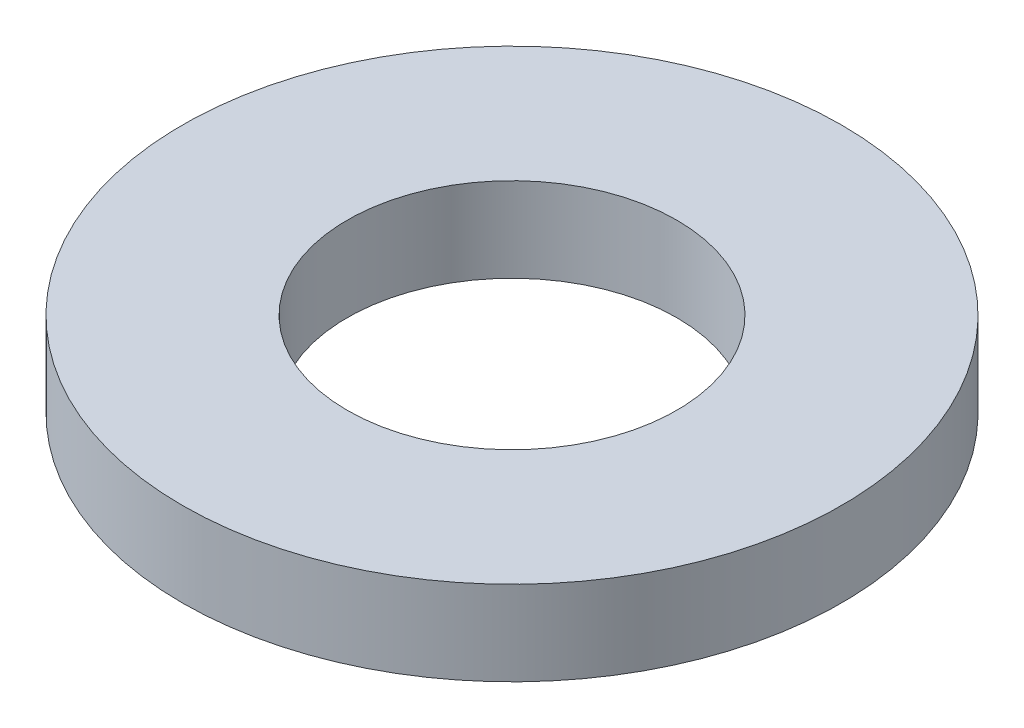
ISO-10303-21;
HEADER;
FILE_DESCRIPTION(('STEP AP214'),'2;1');
FILE_NAME('part.step','',(''),(''),'','','');
FILE_SCHEMA(('AUTOMOTIVE_DESIGN { 1 0 10303 214 1 1 1 1 }'));
ENDSEC;
DATA;
#1=APPLICATION_CONTEXT('core data for automotive mechanical design processes');
#2=APPLICATION_PROTOCOL_DEFINITION('international standard','automotive_design',2000,#1);
#3=PRODUCT_CONTEXT('',#1,'mechanical');
#4=PRODUCT('Part','Part','',(#3));
#5=PRODUCT_RELATED_PRODUCT_CATEGORY('part','',(#4));
#6=PRODUCT_DEFINITION_FORMATION('','',#4);
#7=PRODUCT_DEFINITION_CONTEXT('part definition',#1,'design');
#8=PRODUCT_DEFINITION('design','',#6,#7);
#9=PRODUCT_DEFINITION_SHAPE('','',#8);
#10=(LENGTH_UNIT() NAMED_UNIT(*) SI_UNIT(.MILLI.,.METRE.));
#11=(NAMED_UNIT(*) PLANE_ANGLE_UNIT() SI_UNIT($,.RADIAN.));
#12=(NAMED_UNIT(*) SI_UNIT($,.STERADIAN.) SOLID_ANGLE_UNIT());
#13=UNCERTAINTY_MEASURE_WITH_UNIT(LENGTH_MEASURE(1.E-05),#10,'distance_accuracy_value','');
#14=(GEOMETRIC_REPRESENTATION_CONTEXT(3) GLOBAL_UNCERTAINTY_ASSIGNED_CONTEXT((#13)) GLOBAL_UNIT_ASSIGNED_CONTEXT((#10,
#11,#12)) REPRESENTATION_CONTEXT('',''));
#15=CARTESIAN_POINT('',(0.,0.,0.));
#16=DIRECTION('',(0.,0.,1.));
#17=DIRECTION('',(1.,0.,0.));
#18=AXIS2_PLACEMENT_3D('',#15,#16,#17);
#19=CARTESIAN_POINT('',(3.9624,1.016000000254,0.));
#20=DIRECTION('',(0.,1.,0.));
#21=DIRECTION('',(0.,0.,1.));
#22=AXIS2_PLACEMENT_3D('',#19,#20,#21);
#23=PLANE('',#22);
#24=CARTESIAN_POINT('',(0.,1.016000000254,0.));
#25=DIRECTION('',(0.,-1.,0.));
#26=DIRECTION('',(0.,0.,-1.));
#27=AXIS2_PLACEMENT_3D('',#24,#25,#26);
#28=CIRCLE('',#27,1.9812);
#29=CARTESIAN_POINT('',(0.,1.016000000254,-1.9812));
#30=VERTEX_POINT('',#29);
#31=EDGE_CURVE('E10',#30,#30,#28,.T.);
#32=ORIENTED_EDGE('',*,*,#31,.T.);
#33=EDGE_LOOP('',(#32));
#34=FACE_BOUND('',#33,.T.);
#35=CARTESIAN_POINT('',(0.,1.016000000254,0.));
#36=DIRECTION('',(0.,-1.,0.));
#37=DIRECTION('',(0.,0.,-1.));
#38=AXIS2_PLACEMENT_3D('',#35,#36,#37);
#39=CIRCLE('',#38,3.9624);
#40=CARTESIAN_POINT('',(0.,1.016000000254,-3.9624));
#41=VERTEX_POINT('',#40);
#42=EDGE_CURVE('E49',#41,#41,#39,.T.);
#43=ORIENTED_EDGE('',*,*,#42,.F.);
#44=EDGE_LOOP('',(#43));
#45=FACE_BOUND('',#44,.T.);
#46=ADVANCED_FACE('F35',(#34,#45),#23,.T.);
#47=CARTESIAN_POINT('',(0.,1.016000000254,0.));
#48=DIRECTION('',(0.,-1.,0.));
#49=DIRECTION('',(0.,0.,-1.));
#50=AXIS2_PLACEMENT_3D('',#47,#48,#49);
#51=CYLINDRICAL_SURFACE('',#50,1.9812);
#52=CARTESIAN_POINT('',(0.,0.,0.));
#53=DIRECTION('',(0.,-1.,0.));
#54=DIRECTION('',(0.,0.,-1.));
#55=AXIS2_PLACEMENT_3D('',#52,#53,#54);
#56=CIRCLE('',#55,1.9812);
#57=CARTESIAN_POINT('',(0.,0.,-1.9812));
#58=VERTEX_POINT('',#57);
#59=EDGE_CURVE('E41',#58,#58,#56,.T.);
#60=ORIENTED_EDGE('',*,*,#59,.T.);
#61=EDGE_LOOP('',(#60));
#62=FACE_BOUND('',#61,.T.);
#63=ORIENTED_EDGE('',*,*,#31,.F.);
#64=EDGE_LOOP('',(#63));
#65=FACE_BOUND('',#64,.T.);
#66=ADVANCED_FACE('F59',(#62,#65),#51,.F.);
#67=CARTESIAN_POINT('',(1.9812,0.,0.));
#68=DIRECTION('',(0.,-1.,0.));
#69=DIRECTION('',(0.,0.,-1.));
#70=AXIS2_PLACEMENT_3D('',#67,#68,#69);
#71=PLANE('',#70);
#72=CARTESIAN_POINT('',(0.,0.,0.));
#73=DIRECTION('',(0.,-1.,0.));
#74=DIRECTION('',(0.,0.,-1.));
#75=AXIS2_PLACEMENT_3D('',#72,#73,#74);
#76=CIRCLE('',#75,3.9624);
#77=CARTESIAN_POINT('',(0.,0.,-3.9624));
#78=VERTEX_POINT('',#77);
#79=EDGE_CURVE('E45',#78,#78,#76,.T.);
#80=ORIENTED_EDGE('',*,*,#79,.T.);
#81=EDGE_LOOP('',(#80));
#82=FACE_BOUND('',#81,.T.);
#83=ORIENTED_EDGE('',*,*,#59,.F.);
#84=EDGE_LOOP('',(#83));
#85=FACE_BOUND('',#84,.T.);
#86=ADVANCED_FACE('F63',(#82,#85),#71,.T.);
#87=CARTESIAN_POINT('',(0.,1.016000000254,0.));
#88=DIRECTION('',(0.,-1.,0.));
#89=DIRECTION('',(0.,0.,-1.));
#90=AXIS2_PLACEMENT_3D('',#87,#88,#89);
#91=CYLINDRICAL_SURFACE('',#90,3.9624);
#92=ORIENTED_EDGE('',*,*,#42,.T.);
#93=EDGE_LOOP('',(#92));
#94=FACE_BOUND('',#93,.T.);
#95=ORIENTED_EDGE('',*,*,#79,.F.);
#96=EDGE_LOOP('',(#95));
#97=FACE_BOUND('',#96,.T.);
#98=ADVANCED_FACE('F55',(#94,#97),#91,.T.);
#99=CLOSED_SHELL('',(#46,#66,#86,#98));
#100=MANIFOLD_SOLID_BREP('B2',#99);
#101=ADVANCED_BREP_SHAPE_REPRESENTATION('',(#18,#100),#14);
#102=SHAPE_DEFINITION_REPRESENTATION(#9,#101);
ENDSEC;
END-ISO-10303-21;
